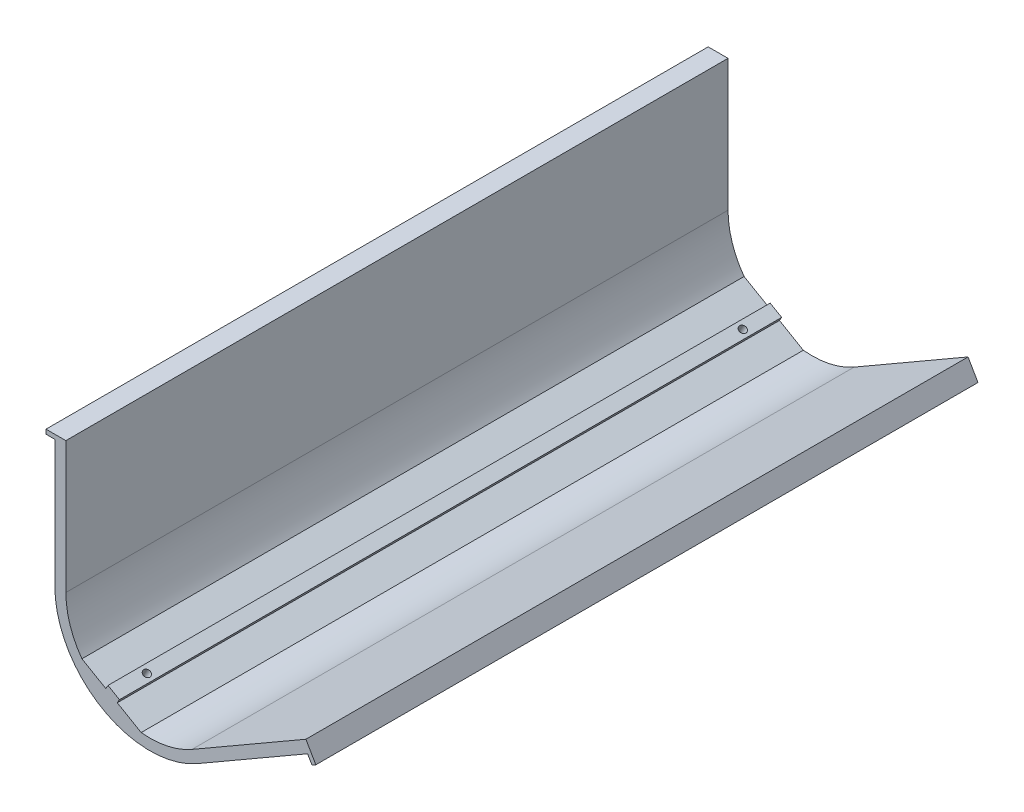
ISO-10303-21;
HEADER;
FILE_DESCRIPTION(('STEP AP214'),'2;1');
FILE_NAME('part.step','',(''),(''),'','','');
FILE_SCHEMA(('AUTOMOTIVE_DESIGN { 1 0 10303 214 1 1 1 1 }'));
ENDSEC;
DATA;
#1=APPLICATION_CONTEXT('core data for automotive mechanical design processes');
#2=APPLICATION_PROTOCOL_DEFINITION('international standard','automotive_design',2000,#1);
#3=PRODUCT_CONTEXT('',#1,'mechanical');
#4=PRODUCT('Part','Part','',(#3));
#5=PRODUCT_RELATED_PRODUCT_CATEGORY('part','',(#4));
#6=PRODUCT_DEFINITION_FORMATION('','',#4);
#7=PRODUCT_DEFINITION_CONTEXT('part definition',#1,'design');
#8=PRODUCT_DEFINITION('design','',#6,#7);
#9=PRODUCT_DEFINITION_SHAPE('','',#8);
#10=(LENGTH_UNIT() NAMED_UNIT(*) SI_UNIT(.MILLI.,.METRE.));
#11=(NAMED_UNIT(*) PLANE_ANGLE_UNIT() SI_UNIT($,.RADIAN.));
#12=(NAMED_UNIT(*) SI_UNIT($,.STERADIAN.) SOLID_ANGLE_UNIT());
#13=UNCERTAINTY_MEASURE_WITH_UNIT(LENGTH_MEASURE(1.E-05),#10,'distance_accuracy_value','');
#14=(GEOMETRIC_REPRESENTATION_CONTEXT(3) GLOBAL_UNCERTAINTY_ASSIGNED_CONTEXT((#13)) GLOBAL_UNIT_ASSIGNED_CONTEXT((#10,
#11,#12)) REPRESENTATION_CONTEXT('',''));
#15=CARTESIAN_POINT('',(0.,0.,0.));
#16=DIRECTION('',(0.,0.,1.));
#17=DIRECTION('',(1.,0.,0.));
#18=AXIS2_PLACEMENT_3D('',#15,#16,#17);
#19=CARTESIAN_POINT('',(2.27010102372575,-22.3839282625581,459.654933865598));
#20=DIRECTION('',(-0.499999999999999,-0.86602540378444,0.));
#21=DIRECTION('',(0.86602540378444,-0.499999999999999,0.));
#22=AXIS2_PLACEMENT_3D('',#19,#20,#21);
#23=PLANE('',#22);
#24=DIRECTION('',(0.,0.,1.));
#25=VECTOR('',#24,1.);
#26=CARTESIAN_POINT('',(13.0974318643345,-28.6350906379887,300.));
#27=LINE('',#26,#25);
#28=CARTESIAN_POINT('',(13.0974318643345,-28.6350906379887,0.));
#29=VERTEX_POINT('',#28);
#30=CARTESIAN_POINT('',(13.0974318643345,-28.6350906379887,300.));
#31=VERTEX_POINT('',#30);
#32=EDGE_CURVE('E53',#29,#31,#27,.T.);
#33=ORIENTED_EDGE('',*,*,#32,.F.);
#34=DIRECTION('',(-0.86602540378444,0.499999999999999,0.));
#35=VECTOR('',#34,1.);
#36=CARTESIAN_POINT('',(2.27010102372575,-22.3839282625581,0.));
#37=LINE('',#36,#35);
#38=CARTESIAN_POINT('',(2.27010102372574,-22.3839282625581,0.));
#39=VERTEX_POINT('',#38);
#40=EDGE_CURVE('E225',#29,#39,#37,.T.);
#41=ORIENTED_EDGE('',*,*,#40,.T.);
#42=DIRECTION('',(0.,0.,-1.));
#43=VECTOR('',#42,1.);
#44=CARTESIAN_POINT('',(2.27010102372574,-22.3839282625581,459.654933865598));
#45=LINE('',#44,#43);
#46=CARTESIAN_POINT('',(2.27010102372574,-22.3839282625581,300.));
#47=VERTEX_POINT('',#46);
#48=EDGE_CURVE('E221',#47,#39,#45,.T.);
#49=ORIENTED_EDGE('',*,*,#48,.F.);
#50=DIRECTION('',(-0.86602540378444,0.499999999999999,0.));
#51=VECTOR('',#50,1.);
#52=CARTESIAN_POINT('',(2.27010102372575,-22.3839282625581,300.));
#53=LINE('',#52,#51);
#54=EDGE_CURVE('E267',#31,#47,#53,.T.);
#55=ORIENTED_EDGE('',*,*,#54,.F.);
#56=EDGE_LOOP('',(#33,#41,#49,#55));
#57=FACE_BOUND('',#56,.T.);
#58=ADVANCED_FACE('F33',(#57),#23,.F.);
#59=DIRECTION('',(0.,0.,-1.));
#60=VECTOR('',#59,1.);
#61=CARTESIAN_POINT('',(18.2935842870411,-31.6350906379887,300.));
#62=LINE('',#61,#60);
#63=CARTESIAN_POINT('',(18.2935842870411,-31.6350906379887,300.));
#64=VERTEX_POINT('',#63);
#65=CARTESIAN_POINT('',(18.2935842870411,-31.6350906379887,0.));
#66=VERTEX_POINT('',#65);
#67=EDGE_CURVE('E182',#64,#66,#62,.T.);
#68=ORIENTED_EDGE('',*,*,#67,.F.);
#69=CARTESIAN_POINT('',(29.1209151276498,-37.8862530134192,300.));
#70=VERTEX_POINT('',#69);
#71=EDGE_CURVE('E265',#70,#64,#53,.T.);
#72=ORIENTED_EDGE('',*,*,#71,.F.);
#73=DIRECTION('',(0.,0.,-1.));
#74=VECTOR('',#73,1.);
#75=CARTESIAN_POINT('',(29.1209151276498,-37.8862530134192,459.654933865598));
#76=LINE('',#75,#74);
#77=CARTESIAN_POINT('',(29.1209151276498,-37.8862530134192,0.));
#78=VERTEX_POINT('',#77);
#79=EDGE_CURVE('E229',#70,#78,#76,.T.);
#80=ORIENTED_EDGE('',*,*,#79,.T.);
#81=EDGE_CURVE('E222',#78,#66,#37,.T.);
#82=ORIENTED_EDGE('',*,*,#81,.T.);
#83=EDGE_LOOP('',(#68,#72,#80,#82));
#84=FACE_BOUND('',#83,.T.);
#85=ADVANCED_FACE('F360',(#84),#23,.F.);
#86=CARTESIAN_POINT('',(33.0940107675842,0.,459.654933865598));
#87=DIRECTION('',(0.,0.,-1.));
#88=DIRECTION('',(-1.,0.,0.));
#89=AXIS2_PLACEMENT_3D('',#86,#87,#88);
#90=CYLINDRICAL_SURFACE('',#89,43.0940107675849);
#91=CARTESIAN_POINT('',(9.10518694657025,-35.799861671815,285.));
#92=CARTESIAN_POINT('',(9.10519244447353,-35.7998663266525,285.161297097093));
#93=CARTESIAN_POINT('',(9.11652316812617,-35.8074659248552,285.32270657392));
#94=CARTESIAN_POINT('',(9.16159802631115,-35.8376072181925,285.641066985922));
#95=CARTESIAN_POINT('',(9.19536812511742,-35.8601662225764,285.798012536322));
#96=CARTESIAN_POINT('',(9.28445875797792,-35.9193797442514,286.102787623212));
#97=CARTESIAN_POINT('',(9.33976776572867,-35.9560267223882,286.250621986524));
#98=CARTESIAN_POINT('',(9.47051911939522,-36.0420657217431,286.533038598448));
#99=CARTESIAN_POINT('',(9.54595691016941,-36.0914548593282,286.667623835914));
#100=CARTESIAN_POINT('',(9.71517680704267,-36.2012989670421,286.919987804878));
#101=CARTESIAN_POINT('',(9.80898618631744,-36.2617703804664,287.037741093674));
#102=CARTESIAN_POINT('',(10.0124622146195,-36.3916256307078,287.252880651108));
#103=CARTESIAN_POINT('',(10.1221295302732,-36.461009842182,287.350266063111));
#104=CARTESIAN_POINT('',(10.3545529188578,-36.6064147399901,287.521984909403));
#105=CARTESIAN_POINT('',(10.4773209078901,-36.6824414566216,287.596297112449));
#106=CARTESIAN_POINT('',(10.7325708372993,-36.838595646703,287.719624183307));
#107=CARTESIAN_POINT('',(10.8650526618639,-36.9187230712592,287.768639352663));
#108=CARTESIAN_POINT('',(11.1358908755815,-37.0804471556159,287.839909905808));
#109=CARTESIAN_POINT('',(11.2742381381263,-37.1620414267307,287.862205389749));
#110=CARTESIAN_POINT('',(11.5531171456246,-37.3243847083736,287.879527544094));
#111=CARTESIAN_POINT('',(11.6936488630598,-37.4051337295281,287.874554557732));
#112=CARTESIAN_POINT('',(11.9726571680676,-37.5633847751024,287.837513961301));
#113=CARTESIAN_POINT('',(12.1111366703706,-37.6408917624794,287.805489483915));
#114=CARTESIAN_POINT('',(12.3822568887193,-37.790753149233,287.715321921167));
#115=CARTESIAN_POINT('',(12.5148975664079,-37.8631075147624,287.657178664252));
#116=CARTESIAN_POINT('',(12.770543071781,-38.0009414950658,287.516375312336));
#117=CARTESIAN_POINT('',(12.8935401343535,-38.0664155839331,287.433695711658));
#118=CARTESIAN_POINT('',(13.1261155043288,-38.1889280804036,287.246180826693));
#119=CARTESIAN_POINT('',(13.2356936389436,-38.245966379386,287.141345257165));
#120=CARTESIAN_POINT('',(13.4383180949122,-38.3504962395822,286.912250817473));
#121=CARTESIAN_POINT('',(13.5313317908603,-38.3979689840718,286.787954502241));
#122=CARTESIAN_POINT('',(13.6977027205264,-38.4822780645245,286.523597950881));
#123=CARTESIAN_POINT('',(13.7710599451993,-38.5191143955932,286.383537707497));
#124=CARTESIAN_POINT('',(13.8958314683849,-38.5814536328349,286.091604706992));
#125=CARTESIAN_POINT('',(13.947244297232,-38.6069557799368,285.939731159511));
#126=CARTESIAN_POINT('',(14.0264906761579,-38.6461565118039,285.628493952112));
#127=CARTESIAN_POINT('',(14.0543245425335,-38.6598552549044,285.469130392698));
#128=CARTESIAN_POINT('',(14.0854935222108,-38.6751902858889,285.147765620562));
#129=CARTESIAN_POINT('',(14.088875733929,-38.67684976365,284.98577008139));
#130=CARTESIAN_POINT('',(14.0711577931146,-38.6681383367068,284.663450885273));
#131=CARTESIAN_POINT('',(14.0500577860039,-38.6577675034614,284.503127218403));
#132=CARTESIAN_POINT('',(13.984079768996,-38.6251943536176,284.188851302327));
#133=CARTESIAN_POINT('',(13.9392234513303,-38.603002830556,284.034893378508));
#134=CARTESIAN_POINT('',(13.8271632725371,-38.5471950603565,283.737543984934));
#135=CARTESIAN_POINT('',(13.7599591805395,-38.513578695191,283.59415262436));
#136=CARTESIAN_POINT('',(13.6051804337481,-38.435488196064,283.321766254255));
#137=CARTESIAN_POINT('',(13.5175748194409,-38.3909975551453,283.192793569926));
#138=CARTESIAN_POINT('',(13.3247482749117,-38.2920583983756,282.953130642489));
#139=CARTESIAN_POINT('',(13.21952714891,-38.2376097718503,282.842440602601));
#140=CARTESIAN_POINT('',(12.9944859369292,-38.1197978883274,282.642307773289));
#141=CARTESIAN_POINT('',(12.8746429974715,-38.0564206516239,282.552898906233));
#142=CARTESIAN_POINT('',(12.6240935984965,-37.9222417957547,282.398098649762));
#143=CARTESIAN_POINT('',(12.4933872135474,-37.8514402275497,282.332707095504));
#144=CARTESIAN_POINT('',(12.2251004680357,-37.704187082144,282.227856563488));
#145=CARTESIAN_POINT('',(12.0875258759193,-37.6277402212668,282.188376205066));
#146=CARTESIAN_POINT('',(11.8094260598235,-37.4711311969166,282.136398812612));
#147=CARTESIAN_POINT('',(11.6689008696931,-37.390969076052,282.123901469203));
#148=CARTESIAN_POINT('',(11.3892147817137,-37.2293115097064,282.126247952406));
#149=CARTESIAN_POINT('',(11.2500517644559,-37.1478189557116,282.141038732099));
#150=CARTESIAN_POINT('',(10.9767234348156,-36.9857353685124,282.197431503953));
#151=CARTESIAN_POINT('',(10.8425581309257,-36.9051443368402,282.239033541672));
#152=CARTESIAN_POINT('',(10.5829137161413,-36.7473451089797,282.347855622046));
#153=CARTESIAN_POINT('',(10.4574344813431,-36.6701368645429,282.415075299187));
#154=CARTESIAN_POINT('',(10.2185290308157,-36.5215814556957,282.573217511789));
#155=CARTESIAN_POINT('',(10.1051025246018,-36.4502341500393,282.664139475816));
#156=CARTESIAN_POINT('',(9.89308124331671,-36.3156503243752,282.867302345702));
#157=CARTESIAN_POINT('',(9.79451391062923,-36.2524288423668,282.979581851251));
#158=CARTESIAN_POINT('',(9.61498881558282,-36.1364186011862,283.222215969229));
#159=CARTESIAN_POINT('',(9.5340353602606,-36.0836323939894,283.352574989824));
#160=CARTESIAN_POINT('',(9.39174688472133,-35.9903281847304,283.627835036746));
#161=CARTESIAN_POINT('',(9.33043853945913,-35.9498268675561,283.772755487625));
#162=CARTESIAN_POINT('',(9.22920909909171,-35.8827079355814,284.072779367351));
#163=CARTESIAN_POINT('',(9.18926303646849,-35.8560741138832,284.227870669685));
#164=CARTESIAN_POINT('',(9.14210261175095,-35.8245769595269,284.48658744668));
#165=CARTESIAN_POINT('',(9.12827546427715,-35.8153238252842,284.588541978836));
#166=CARTESIAN_POINT('',(9.10981588029737,-35.8029646972843,284.793649007773));
#167=CARTESIAN_POINT('',(9.10518342899079,-35.7998586936321,284.896801502625));
#168=CARTESIAN_POINT('',(9.10518694657025,-35.799861671815,285.));
#169=B_SPLINE_CURVE_WITH_KNOTS('',3,(#91,#92,#93,#94,#95,#96,#97,#98,#99,#100,#101,#102,#103,
#104,#105,#106,#107,#108,#109,#110,#111,#112,#113,#114,#115,#116,#117,#118,#119,#120,#121,#122,
#123,#124,#125,#126,#127,#128,#129,#130,#131,#132,#133,#134,#135,#136,#137,#138,#139,#140,#141,
#142,#143,#144,#145,#146,#147,#148,#149,#150,#151,#152,#153,#154,#155,#156,#157,#158,#159,#160,
#161,#162,#163,#164,#165,#166,#167,#168),.UNSPECIFIED.,.T.,.F.,(4,2,2,2,2,2,2,2,2,2,2,2,2,2,2,2,
2,2,2,2,2,2,2,2,2,2,2,2,2,2,2,2,2,2,2,2,2,2,4),(0.,0.483514542357615,0.967589528847677,
1.45140582327215,1.935112722839,2.41954321885344,2.90399408498874,3.38888941544184,
3.87377896570989,4.3579398924167,4.84209472492526,5.32547904302915,5.80886653616381,
6.29263934239359,6.77641837723653,7.26113997387421,7.74586179356263,8.23061607107052,
8.71536384580417,9.19917765713678,9.68298859467953,10.1663585171958,10.6497334334575,
11.1338467116872,11.6179653707357,12.1028506270876,12.5877325553981,13.0722138779189,
13.556689645543,14.0402246056368,14.5237603873553,15.0072892701854,15.4908064967615,
15.9752060374027,16.4597238931478,16.9448968867766,17.4295015802977,17.7388565249918,
18.0482109717202),.UNSPECIFIED.);
#170=CARTESIAN_POINT('',(9.10518694657025,-35.799861671815,285.));
#171=VERTEX_POINT('',#170);
#172=EDGE_CURVE('E37',#171,#171,#169,.T.);
#173=ORIENTED_EDGE('',*,*,#172,.T.);
#174=EDGE_LOOP('',(#173));
#175=FACE_BOUND('',#174,.T.);
#176=CARTESIAN_POINT('',(9.10518694657026,-35.799861671815,15.));
#177=CARTESIAN_POINT('',(9.10519244447353,-35.7998663266525,15.1612970970931));
#178=CARTESIAN_POINT('',(9.11652316812617,-35.8074659248552,15.3227065739202));
#179=CARTESIAN_POINT('',(9.16159802631115,-35.8376072181925,15.6410669859224));
#180=CARTESIAN_POINT('',(9.19536812511742,-35.8601662225764,15.7980125363219));
#181=CARTESIAN_POINT('',(9.28445875797792,-35.9193797442514,16.1027876232124));
#182=CARTESIAN_POINT('',(9.33976776572868,-35.9560267223882,16.2506219865244));
#183=CARTESIAN_POINT('',(9.47051911939522,-36.0420657217431,16.5330385984478));
#184=CARTESIAN_POINT('',(9.5459569101694,-36.0914548593282,16.6676238359136));
#185=CARTESIAN_POINT('',(9.71517680704266,-36.2012989670421,16.919987804878));
#186=CARTESIAN_POINT('',(9.80898618631743,-36.2617703804664,17.0377410936741));
#187=CARTESIAN_POINT('',(10.0124622146195,-36.3916256307078,17.2528806511076));
#188=CARTESIAN_POINT('',(10.1221295302732,-36.461009842182,17.3502660631113));
#189=CARTESIAN_POINT('',(10.3545529188578,-36.6064147399901,17.5219849094027));
#190=CARTESIAN_POINT('',(10.47732090789,-36.6824414566216,17.5962971124491));
#191=CARTESIAN_POINT('',(10.7325708372993,-36.8385956467031,17.7196241833065));
#192=CARTESIAN_POINT('',(10.865052661864,-36.9187230712592,17.7686393526634));
#193=CARTESIAN_POINT('',(11.1358908755815,-37.0804471556159,17.8399099058084));
#194=CARTESIAN_POINT('',(11.2742381381263,-37.1620414267307,17.862205389749));
#195=CARTESIAN_POINT('',(11.5531171456246,-37.3243847083736,17.8795275440942));
#196=CARTESIAN_POINT('',(11.6936488630598,-37.4051337295281,17.8745545577315));
#197=CARTESIAN_POINT('',(11.9726571680676,-37.5633847751024,17.8375139613011));
#198=CARTESIAN_POINT('',(12.1111366703706,-37.6408917624794,17.8054894839145));
#199=CARTESIAN_POINT('',(12.3822568887194,-37.790753149233,17.715321921167));
#200=CARTESIAN_POINT('',(12.5148975664079,-37.8631075147624,17.6571786642518));
#201=CARTESIAN_POINT('',(12.770543071781,-38.0009414950658,17.5163753123363));
#202=CARTESIAN_POINT('',(12.8935401343535,-38.0664155839331,17.4336957116579));
#203=CARTESIAN_POINT('',(13.1261155043288,-38.1889280804036,17.2461808266934));
#204=CARTESIAN_POINT('',(13.2356936389436,-38.245966379386,17.1413452571648));
#205=CARTESIAN_POINT('',(13.4383180949122,-38.3504962395822,16.9122508174725));
#206=CARTESIAN_POINT('',(13.5313317908603,-38.3979689840718,16.7879545022411));
#207=CARTESIAN_POINT('',(13.6977027205264,-38.4822780645245,16.5235979508806));
#208=CARTESIAN_POINT('',(13.7710599451993,-38.5191143955932,16.3835377074974));
#209=CARTESIAN_POINT('',(13.8958314683849,-38.5814536328349,16.0916047069917));
#210=CARTESIAN_POINT('',(13.947244297232,-38.6069557799368,15.9397311595107));
#211=CARTESIAN_POINT('',(14.0264906761579,-38.6461565118039,15.6284939521119));
#212=CARTESIAN_POINT('',(14.0543245425336,-38.6598552549044,15.4691303926981));
#213=CARTESIAN_POINT('',(14.0854935222109,-38.6751902858889,15.1477656205615));
#214=CARTESIAN_POINT('',(14.088875733929,-38.67684976365,14.9857700813894));
#215=CARTESIAN_POINT('',(14.0711577931146,-38.6681383367068,14.6634508852726));
#216=CARTESIAN_POINT('',(14.0500577860039,-38.6577675034614,14.5031272184029));
#217=CARTESIAN_POINT('',(13.984079768996,-38.6251943536176,14.1888513023271));
#218=CARTESIAN_POINT('',(13.9392234513303,-38.603002830556,14.0348933785076));
#219=CARTESIAN_POINT('',(13.8271632725371,-38.5471950603565,13.7375439849343));
#220=CARTESIAN_POINT('',(13.7599591805396,-38.513578695191,13.5941526243602));
#221=CARTESIAN_POINT('',(13.6051804337481,-38.435488196064,13.3217662542546));
#222=CARTESIAN_POINT('',(13.5175748194409,-38.3909975551453,13.1927935699264));
#223=CARTESIAN_POINT('',(13.3247482749118,-38.2920583983756,12.9531306424889));
#224=CARTESIAN_POINT('',(13.21952714891,-38.2376097718503,12.842440602601));
#225=CARTESIAN_POINT('',(12.9944859369292,-38.1197978883274,12.6423077732891));
#226=CARTESIAN_POINT('',(12.8746429974715,-38.0564206516239,12.5528989062334));
#227=CARTESIAN_POINT('',(12.6240935984965,-37.9222417957547,12.3980986497617));
#228=CARTESIAN_POINT('',(12.4933872135474,-37.8514402275497,12.3327070955044));
#229=CARTESIAN_POINT('',(12.2251004680357,-37.704187082144,12.2278565634881));
#230=CARTESIAN_POINT('',(12.0875258759193,-37.6277402212668,12.188376205066));
#231=CARTESIAN_POINT('',(11.8094260598235,-37.4711311969166,12.1363988126115));
#232=CARTESIAN_POINT('',(11.6689008696931,-37.390969076052,12.1239014692027));
#233=CARTESIAN_POINT('',(11.3892147817138,-37.2293115097064,12.1262479524056));
#234=CARTESIAN_POINT('',(11.2500517644559,-37.1478189557116,12.1410387320989));
#235=CARTESIAN_POINT('',(10.9767234348156,-36.9857353685124,12.1974315039533));
#236=CARTESIAN_POINT('',(10.8425581309257,-36.9051443368402,12.239033541672));
#237=CARTESIAN_POINT('',(10.5829137161413,-36.7473451089797,12.3478556220465));
#238=CARTESIAN_POINT('',(10.4574344813431,-36.6701368645429,12.4150752991866));
#239=CARTESIAN_POINT('',(10.2185290308158,-36.5215814556957,12.5732175117887));
#240=CARTESIAN_POINT('',(10.1051025246018,-36.4502341500393,12.6641394758155));
#241=CARTESIAN_POINT('',(9.89308124331672,-36.3156503243752,12.8673023457015));
#242=CARTESIAN_POINT('',(9.79451391062925,-36.2524288423668,12.9795818512506));
#243=CARTESIAN_POINT('',(9.61498881558284,-36.1364186011862,13.2222159692288));
#244=CARTESIAN_POINT('',(9.53403536026061,-36.0836323939894,13.3525749898236));
#245=CARTESIAN_POINT('',(9.39174688472133,-35.9903281847304,13.6278350367465));
#246=CARTESIAN_POINT('',(9.33043853945913,-35.9498268675561,13.7727554876249));
#247=CARTESIAN_POINT('',(9.22920909909171,-35.8827079355814,14.0727793673509));
#248=CARTESIAN_POINT('',(9.1892630364685,-35.8560741138833,14.2278706696853));
#249=CARTESIAN_POINT('',(9.14210261175095,-35.8245769595269,14.4865874466799));
#250=CARTESIAN_POINT('',(9.12827546427715,-35.8153238252842,14.5885419788358));
#251=CARTESIAN_POINT('',(9.10981588029738,-35.8029646972843,14.7936490077728));
#252=CARTESIAN_POINT('',(9.1051834289908,-35.7998586936321,14.8968015026252));
#253=CARTESIAN_POINT('',(9.10518694657026,-35.799861671815,15.));
#254=B_SPLINE_CURVE_WITH_KNOTS('',3,(#176,#177,#178,#179,#180,#181,#182,#183,#184,#185,#186,
#187,#188,#189,#190,#191,#192,#193,#194,#195,#196,#197,#198,#199,#200,#201,#202,#203,#204,#205,
#206,#207,#208,#209,#210,#211,#212,#213,#214,#215,#216,#217,#218,#219,#220,#221,#222,#223,#224,
#225,#226,#227,#228,#229,#230,#231,#232,#233,#234,#235,#236,#237,#238,#239,#240,#241,#242,#243,
#244,#245,#246,#247,#248,#249,#250,#251,#252,#253),.UNSPECIFIED.,.T.,.F.,(4,2,2,2,2,2,2,2,2,2,2,
2,2,2,2,2,2,2,2,2,2,2,2,2,2,2,2,2,2,2,2,2,2,2,2,2,2,2,4),(0.,0.483514542357623,
0.967589528847684,1.45140582327213,1.935112722839,2.41954321885344,2.90399408498871,
3.38888941544184,3.8737789657099,4.35793989241672,4.84209472492527,5.32547904302916,
5.80886653616383,6.29263934239359,6.77641837723654,7.26113997387425,7.74586179356267,
8.23061607107055,8.71536384580422,9.1991776571369,9.68298859467958,10.1663585171957,
10.6497334334575,11.1338467116872,11.6179653707357,12.1028506270876,12.5877325553981,
13.0722138779189,13.556689645543,14.0402246056368,14.5237603873553,15.0072892701854,
15.4908064967616,15.9752060374027,16.4597238931479,16.9448968867766,17.4295015802977,
17.7388565249918,18.0482109717202),.UNSPECIFIED.);
#255=CARTESIAN_POINT('',(9.10518694657026,-35.799861671815,15.));
#256=VERTEX_POINT('',#255);
#257=EDGE_CURVE('E305',#256,#256,#254,.T.);
#258=ORIENTED_EDGE('',*,*,#257,.T.);
#259=EDGE_LOOP('',(#258));
#260=FACE_BOUND('',#259,.T.);
#261=CARTESIAN_POINT('',(33.0940107675842,0.,300.));
#262=DIRECTION('',(0.,0.,1.));
#263=DIRECTION('',(1.,0.,0.));
#264=AXIS2_PLACEMENT_3D('',#261,#262,#263);
#265=CIRCLE('',#264,43.0940107675849);
#266=CARTESIAN_POINT('',(-10.0000000000007,0.,300.));
#267=VERTEX_POINT('',#266);
#268=CARTESIAN_POINT('',(54.6410161513771,-37.3205080756885,300.));
#269=VERTEX_POINT('',#268);
#270=EDGE_CURVE('E286',#267,#269,#265,.T.);
#271=ORIENTED_EDGE('',*,*,#270,.F.);
#272=DIRECTION('',(0.,0.,-1.));
#273=VECTOR('',#272,1.);
#274=CARTESIAN_POINT('',(-10.0000000000007,0.,459.654933865598));
#275=LINE('',#274,#273);
#276=CARTESIAN_POINT('',(-10.0000000000007,0.,0.));
#277=VERTEX_POINT('',#276);
#278=EDGE_CURVE('E61',#267,#277,#275,.T.);
#279=ORIENTED_EDGE('',*,*,#278,.T.);
#280=CARTESIAN_POINT('',(33.0940107675842,0.,0.));
#281=DIRECTION('',(0.,0.,1.));
#282=DIRECTION('',(1.,0.,0.));
#283=AXIS2_PLACEMENT_3D('',#280,#281,#282);
#284=CIRCLE('',#283,43.0940107675849);
#285=CARTESIAN_POINT('',(54.6410161513771,-37.3205080756885,0.));
#286=VERTEX_POINT('',#285);
#287=EDGE_CURVE('E251',#277,#286,#284,.T.);
#288=ORIENTED_EDGE('',*,*,#287,.T.);
#289=DIRECTION('',(0.,0.,-1.));
#290=VECTOR('',#289,1.);
#291=CARTESIAN_POINT('',(54.6410161513771,-37.3205080756885,459.654933865598));
#292=LINE('',#291,#290);
#293=EDGE_CURVE('E250',#269,#286,#292,.T.);
#294=ORIENTED_EDGE('',*,*,#293,.F.);
#295=EDGE_LOOP('',(#271,#279,#288,#294));
#296=FACE_BOUND('',#295,.T.);
#297=ADVANCED_FACE('F312',(#175,#260,#296),#90,.T.);
#298=CARTESIAN_POINT('',(54.6410161513771,-37.3205080756885,459.654933865598));
#299=DIRECTION('',(-0.500000000000016,0.866025403784429,0.));
#300=DIRECTION('',(-0.866025403784429,-0.500000000000016,0.));
#301=AXIS2_PLACEMENT_3D('',#298,#299,#300);
#302=PLANE('',#301);
#303=DIRECTION('',(0.866025403784429,0.500000000000016,0.));
#304=VECTOR('',#303,1.);
#305=CARTESIAN_POINT('',(54.6410161513771,-37.3205080756885,300.));
#306=LINE('',#305,#304);
#307=CARTESIAN_POINT('',(104.518010155129,-8.52401216125157,300.));
#308=VERTEX_POINT('',#307);
#309=EDGE_CURVE('E283',#269,#308,#306,.T.);
#310=ORIENTED_EDGE('',*,*,#309,.F.);
#311=ORIENTED_EDGE('',*,*,#293,.T.);
#312=DIRECTION('',(0.866025403784429,0.500000000000016,0.));
#313=VECTOR('',#312,1.);
#314=CARTESIAN_POINT('',(54.6410161513771,-37.3205080756885,0.));
#315=LINE('',#314,#313);
#316=CARTESIAN_POINT('',(104.518010155129,-8.52401216125157,0.));
#317=VERTEX_POINT('',#316);
#318=EDGE_CURVE('E247',#286,#317,#315,.T.);
#319=ORIENTED_EDGE('',*,*,#318,.T.);
#320=DIRECTION('',(0.,0.,-1.));
#321=VECTOR('',#320,1.);
#322=CARTESIAN_POINT('',(104.518010155129,-8.52401216125157,459.654933865598));
#323=LINE('',#322,#321);
#324=EDGE_CURVE('E246',#308,#317,#323,.T.);
#325=ORIENTED_EDGE('',*,*,#324,.F.);
#326=EDGE_LOOP('',(#310,#311,#319,#325));
#327=FACE_BOUND('',#326,.T.);
#328=ADVANCED_FACE('F379',(#327),#302,.F.);
#329=CARTESIAN_POINT('',(104.518010155129,-8.52401216125157,459.654933865598));
#330=DIRECTION('',(0.86602540378443,0.500000000000015,0.));
#331=DIRECTION('',(-0.500000000000015,0.86602540378443,0.));
#332=AXIS2_PLACEMENT_3D('',#329,#330,#331);
#333=PLANE('',#332);
#334=DIRECTION('',(0.500000000000015,-0.86602540378443,0.));
#335=VECTOR('',#334,1.);
#336=CARTESIAN_POINT('',(104.518010155129,-8.52401216125157,300.));
#337=LINE('',#336,#335);
#338=CARTESIAN_POINT('',(106.518010155129,-11.9881137763893,300.));
#339=VERTEX_POINT('',#338);
#340=EDGE_CURVE('E280',#308,#339,#337,.T.);
#341=ORIENTED_EDGE('',*,*,#340,.F.);
#342=ORIENTED_EDGE('',*,*,#324,.T.);
#343=DIRECTION('',(0.500000000000015,-0.86602540378443,0.));
#344=VECTOR('',#343,1.);
#345=CARTESIAN_POINT('',(104.518010155129,-8.52401216125157,0.));
#346=LINE('',#345,#344);
#347=CARTESIAN_POINT('',(106.518010155129,-11.9881137763893,0.));
#348=VERTEX_POINT('',#347);
#349=EDGE_CURVE('E243',#317,#348,#346,.T.);
#350=ORIENTED_EDGE('',*,*,#349,.T.);
#351=DIRECTION('',(0.,0.,-1.));
#352=VECTOR('',#351,1.);
#353=CARTESIAN_POINT('',(106.518010155129,-11.9881137763893,459.654933865598));
#354=LINE('',#353,#352);
#355=EDGE_CURVE('E242',#339,#348,#354,.T.);
#356=ORIENTED_EDGE('',*,*,#355,.F.);
#357=EDGE_LOOP('',(#341,#342,#350,#356));
#358=FACE_BOUND('',#357,.T.);
#359=ADVANCED_FACE('F376',(#358),#333,.F.);
#360=CARTESIAN_POINT('',(106.518010155129,-11.9881137763893,459.654933865598));
#361=DIRECTION('',(-0.500000000000012,0.866025403784432,0.));
#362=DIRECTION('',(-0.866025403784432,-0.500000000000012,0.));
#363=AXIS2_PLACEMENT_3D('',#360,#361,#362);
#364=PLANE('',#363);
#365=DIRECTION('',(0.866025403784432,0.500000000000012,0.));
#366=VECTOR('',#365,1.);
#367=CARTESIAN_POINT('',(106.518010155129,-11.9881137763893,300.));
#368=LINE('',#367,#366);
#369=CARTESIAN_POINT('',(108.250060962698,-10.9881137763893,300.));
#370=VERTEX_POINT('',#369);
#371=EDGE_CURVE('E277',#339,#370,#368,.T.);
#372=ORIENTED_EDGE('',*,*,#371,.F.);
#373=ORIENTED_EDGE('',*,*,#355,.T.);
#374=DIRECTION('',(0.866025403784432,0.500000000000012,0.));
#375=VECTOR('',#374,1.);
#376=CARTESIAN_POINT('',(106.518010155129,-11.9881137763893,0.));
#377=LINE('',#376,#375);
#378=CARTESIAN_POINT('',(108.250060962698,-10.9881137763893,0.));
#379=VERTEX_POINT('',#378);
#380=EDGE_CURVE('E239',#348,#379,#377,.T.);
#381=ORIENTED_EDGE('',*,*,#380,.T.);
#382=DIRECTION('',(0.,0.,-1.));
#383=VECTOR('',#382,1.);
#384=CARTESIAN_POINT('',(108.250060962698,-10.9881137763893,459.654933865598));
#385=LINE('',#384,#383);
#386=EDGE_CURVE('E238',#370,#379,#385,.T.);
#387=ORIENTED_EDGE('',*,*,#386,.F.);
#388=EDGE_LOOP('',(#372,#373,#381,#387));
#389=FACE_BOUND('',#388,.T.);
#390=ADVANCED_FACE('F372',(#389),#364,.F.);
#391=CARTESIAN_POINT('',(106.250060962698,-7.52401216125177,459.654933865598));
#392=DIRECTION('',(-0.866025403784432,-0.500000000000011,0.));
#393=DIRECTION('',(0.500000000000011,-0.866025403784432,0.));
#394=AXIS2_PLACEMENT_3D('',#391,#392,#393);
#395=PLANE('',#394);
#396=DIRECTION('',(-0.500000000000011,0.866025403784432,0.));
#397=VECTOR('',#396,1.);
#398=CARTESIAN_POINT('',(106.250060962698,-7.52401216125177,300.));
#399=LINE('',#398,#397);
#400=CARTESIAN_POINT('',(103.750060962698,-3.19388514232939,300.));
#401=VERTEX_POINT('',#400);
#402=EDGE_CURVE('E274',#370,#401,#399,.T.);
#403=ORIENTED_EDGE('',*,*,#402,.F.);
#404=ORIENTED_EDGE('',*,*,#386,.T.);
#405=DIRECTION('',(-0.500000000000011,0.866025403784432,0.));
#406=VECTOR('',#405,1.);
#407=CARTESIAN_POINT('',(106.250060962698,-7.52401216125177,0.));
#408=LINE('',#407,#406);
#409=CARTESIAN_POINT('',(103.750060962698,-3.19388514232939,0.));
#410=VERTEX_POINT('',#409);
#411=EDGE_CURVE('E235',#379,#410,#408,.T.);
#412=ORIENTED_EDGE('',*,*,#411,.T.);
#413=DIRECTION('',(0.,0.,-1.));
#414=VECTOR('',#413,1.);
#415=CARTESIAN_POINT('',(103.750060962698,-3.19388514232939,459.654933865598));
#416=LINE('',#415,#414);
#417=EDGE_CURVE('E234',#401,#410,#416,.T.);
#418=ORIENTED_EDGE('',*,*,#417,.F.);
#419=EDGE_LOOP('',(#403,#404,#412,#418));
#420=FACE_BOUND('',#419,.T.);
#421=ADVANCED_FACE('F368',(#420),#395,.F.);
#422=CARTESIAN_POINT('',(52.1410161513771,-32.9903810567663,459.654933865598));
#423=DIRECTION('',(0.500000000000015,-0.86602540378443,0.));
#424=DIRECTION('',(0.86602540378443,0.500000000000015,0.));
#425=AXIS2_PLACEMENT_3D('',#422,#423,#424);
#426=PLANE('',#425);
#427=DIRECTION('',(-0.86602540378443,-0.500000000000015,0.));
#428=VECTOR('',#427,1.);
#429=CARTESIAN_POINT('',(52.1410161513771,-32.9903810567663,300.));
#430=LINE('',#429,#428);
#431=CARTESIAN_POINT('',(52.1410161513771,-32.9903810567663,300.));
#432=VERTEX_POINT('',#431);
#433=EDGE_CURVE('E271',#401,#432,#430,.T.);
#434=ORIENTED_EDGE('',*,*,#433,.F.);
#435=ORIENTED_EDGE('',*,*,#417,.T.);
#436=DIRECTION('',(-0.86602540378443,-0.500000000000015,0.));
#437=VECTOR('',#436,1.);
#438=CARTESIAN_POINT('',(52.1410161513771,-32.9903810567663,0.));
#439=LINE('',#438,#437);
#440=CARTESIAN_POINT('',(52.1410161513771,-32.9903810567663,0.));
#441=VERTEX_POINT('',#440);
#442=EDGE_CURVE('E231',#410,#441,#439,.T.);
#443=ORIENTED_EDGE('',*,*,#442,.T.);
#444=DIRECTION('',(0.,0.,-1.));
#445=VECTOR('',#444,1.);
#446=CARTESIAN_POINT('',(52.1410161513771,-32.9903810567663,459.654933865598));
#447=LINE('',#446,#445);
#448=EDGE_CURVE('E230',#432,#441,#447,.T.);
#449=ORIENTED_EDGE('',*,*,#448,.F.);
#450=EDGE_LOOP('',(#434,#435,#443,#449));
#451=FACE_BOUND('',#450,.T.);
#452=ADVANCED_FACE('F364',(#451),#426,.F.);
#453=CARTESIAN_POINT('',(33.0940107675842,0.,459.654933865598));
#454=DIRECTION('',(0.,0.,-1.));
#455=DIRECTION('',(-1.,0.,0.));
#456=AXIS2_PLACEMENT_3D('',#453,#454,#455);
#457=CYLINDRICAL_SURFACE('',#456,38.0940107675849);
#458=CARTESIAN_POINT('',(33.0940107675842,0.,300.));
#459=DIRECTION('',(0.,0.,1.));
#460=DIRECTION('',(1.,0.,0.));
#461=AXIS2_PLACEMENT_3D('',#458,#459,#460);
#462=CIRCLE('',#461,38.0940107675849);
#463=EDGE_CURVE('E268',#432,#70,#462,.F.);
#464=ORIENTED_EDGE('',*,*,#463,.F.);
#465=ORIENTED_EDGE('',*,*,#448,.T.);
#466=CARTESIAN_POINT('',(33.0940107675842,0.,0.));
#467=DIRECTION('',(0.,0.,-1.));
#468=DIRECTION('',(1.,0.,0.));
#469=AXIS2_PLACEMENT_3D('',#466,#467,#468);
#470=CIRCLE('',#469,38.0940107675849);
#471=EDGE_CURVE('E226',#441,#78,#470,.T.);
#472=ORIENTED_EDGE('',*,*,#471,.T.);
#473=ORIENTED_EDGE('',*,*,#79,.F.);
#474=EDGE_LOOP('',(#464,#465,#472,#473));
#475=FACE_BOUND('',#474,.T.);
#476=ADVANCED_FACE('F356',(#475),#457,.F.);
#477=CARTESIAN_POINT('',(33.0940107675842,0.,459.654933865598));
#478=DIRECTION('',(0.,0.,-1.));
#479=DIRECTION('',(-1.,0.,0.));
#480=AXIS2_PLACEMENT_3D('',#477,#478,#479);
#481=CYLINDRICAL_SURFACE('',#480,38.0940107675849);
#482=CARTESIAN_POINT('',(33.0940107675842,0.,300.));
#483=DIRECTION('',(0.,0.,1.));
#484=DIRECTION('',(1.,0.,0.));
#485=AXIS2_PLACEMENT_3D('',#482,#483,#484);
#486=CIRCLE('',#485,38.0940107675849);
#487=CARTESIAN_POINT('',(-5.00000000000073,0.,300.));
#488=VERTEX_POINT('',#487);
#489=EDGE_CURVE('E262',#47,#488,#486,.F.);
#490=ORIENTED_EDGE('',*,*,#489,.F.);
#491=ORIENTED_EDGE('',*,*,#48,.T.);
#492=CARTESIAN_POINT('',(33.0940107675842,0.,0.));
#493=DIRECTION('',(0.,0.,-1.));
#494=DIRECTION('',(1.,0.,0.));
#495=AXIS2_PLACEMENT_3D('',#492,#493,#494);
#496=CIRCLE('',#495,38.0940107675849);
#497=CARTESIAN_POINT('',(-5.00000000000073,0.,0.));
#498=VERTEX_POINT('',#497);
#499=EDGE_CURVE('E218',#39,#498,#496,.T.);
#500=ORIENTED_EDGE('',*,*,#499,.T.);
#501=DIRECTION('',(0.,0.,-1.));
#502=VECTOR('',#501,1.);
#503=CARTESIAN_POINT('',(-5.00000000000073,0.,459.654933865598));
#504=LINE('',#503,#502);
#505=EDGE_CURVE('E217',#488,#498,#504,.T.);
#506=ORIENTED_EDGE('',*,*,#505,.F.);
#507=EDGE_LOOP('',(#490,#491,#500,#506));
#508=FACE_BOUND('',#507,.T.);
#509=ADVANCED_FACE('F352',(#508),#481,.F.);
#510=CARTESIAN_POINT('',(-5.00000000000073,0.,459.654933865598));
#511=DIRECTION('',(-1.,0.,0.));
#512=DIRECTION('',(0.,-1.,0.));
#513=AXIS2_PLACEMENT_3D('',#510,#511,#512);
#514=PLANE('',#513);
#515=DIRECTION('',(0.,1.,0.));
#516=VECTOR('',#515,1.);
#517=CARTESIAN_POINT('',(-5.00000000000073,0.,300.));
#518=LINE('',#517,#516);
#519=CARTESIAN_POINT('',(-5.00000000000044,59.5929918288719,300.));
#520=VERTEX_POINT('',#519);
#521=EDGE_CURVE('E259',#488,#520,#518,.T.);
#522=ORIENTED_EDGE('',*,*,#521,.F.);
#523=ORIENTED_EDGE('',*,*,#505,.T.);
#524=DIRECTION('',(0.,1.,0.));
#525=VECTOR('',#524,1.);
#526=CARTESIAN_POINT('',(-5.00000000000073,0.,0.));
#527=LINE('',#526,#525);
#528=CARTESIAN_POINT('',(-5.00000000000044,59.5929918288719,0.));
#529=VERTEX_POINT('',#528);
#530=EDGE_CURVE('E214',#498,#529,#527,.T.);
#531=ORIENTED_EDGE('',*,*,#530,.T.);
#532=DIRECTION('',(0.,0.,-1.));
#533=VECTOR('',#532,1.);
#534=CARTESIAN_POINT('',(-5.00000000000044,59.5929918288719,459.654933865598));
#535=LINE('',#534,#533);
#536=EDGE_CURVE('E213',#520,#529,#535,.T.);
#537=ORIENTED_EDGE('',*,*,#536,.F.);
#538=EDGE_LOOP('',(#522,#523,#531,#537));
#539=FACE_BOUND('',#538,.T.);
#540=ADVANCED_FACE('F348',(#539),#514,.F.);
#541=CARTESIAN_POINT('',(-14.0000000000004,59.5929918288719,459.654933865598));
#542=DIRECTION('',(0.,-1.,0.));
#543=DIRECTION('',(0.,0.,-1.));
#544=AXIS2_PLACEMENT_3D('',#541,#542,#543);
#545=PLANE('',#544);
#546=DIRECTION('',(-1.,0.,0.));
#547=VECTOR('',#546,1.);
#548=CARTESIAN_POINT('',(-14.0000000000004,59.5929918288719,300.));
#549=LINE('',#548,#547);
#550=CARTESIAN_POINT('',(-14.0000000000004,59.5929918288719,300.));
#551=VERTEX_POINT('',#550);
#552=EDGE_CURVE('E256',#520,#551,#549,.T.);
#553=ORIENTED_EDGE('',*,*,#552,.F.);
#554=ORIENTED_EDGE('',*,*,#536,.T.);
#555=DIRECTION('',(-1.,0.,0.));
#556=VECTOR('',#555,1.);
#557=CARTESIAN_POINT('',(-14.0000000000004,59.5929918288719,0.));
#558=LINE('',#557,#556);
#559=CARTESIAN_POINT('',(-14.0000000000004,59.5929918288719,0.));
#560=VERTEX_POINT('',#559);
#561=EDGE_CURVE('E210',#529,#560,#558,.T.);
#562=ORIENTED_EDGE('',*,*,#561,.T.);
#563=DIRECTION('',(0.,0.,-1.));
#564=VECTOR('',#563,1.);
#565=CARTESIAN_POINT('',(-14.0000000000004,59.5929918288719,459.654933865598));
#566=LINE('',#565,#564);
#567=EDGE_CURVE('E209',#551,#560,#566,.T.);
#568=ORIENTED_EDGE('',*,*,#567,.F.);
#569=EDGE_LOOP('',(#553,#554,#562,#568));
#570=FACE_BOUND('',#569,.T.);
#571=ADVANCED_FACE('F344',(#570),#545,.F.);
#572=CARTESIAN_POINT('',(-14.0000000000004,57.592991828872,459.654933865598));
#573=DIRECTION('',(1.,0.,0.));
#574=DIRECTION('',(0.,0.,-1.));
#575=AXIS2_PLACEMENT_3D('',#572,#573,#574);
#576=PLANE('',#575);
#577=DIRECTION('',(0.,-1.,0.));
#578=VECTOR('',#577,1.);
#579=CARTESIAN_POINT('',(-14.0000000000004,57.592991828872,300.));
#580=LINE('',#579,#578);
#581=CARTESIAN_POINT('',(-14.0000000000004,57.592991828872,300.));
#582=VERTEX_POINT('',#581);
#583=EDGE_CURVE('E45',#551,#582,#580,.T.);
#584=ORIENTED_EDGE('',*,*,#583,.F.);
#585=ORIENTED_EDGE('',*,*,#567,.T.);
#586=DIRECTION('',(0.,-1.,0.));
#587=VECTOR('',#586,1.);
#588=CARTESIAN_POINT('',(-14.0000000000004,57.592991828872,0.));
#589=LINE('',#588,#587);
#590=CARTESIAN_POINT('',(-14.0000000000004,57.592991828872,0.));
#591=VERTEX_POINT('',#590);
#592=EDGE_CURVE('E206',#560,#591,#589,.T.);
#593=ORIENTED_EDGE('',*,*,#592,.T.);
#594=DIRECTION('',(0.,0.,-1.));
#595=VECTOR('',#594,1.);
#596=CARTESIAN_POINT('',(-14.0000000000004,57.592991828872,459.654933865598));
#597=LINE('',#596,#595);
#598=EDGE_CURVE('E205',#582,#591,#597,.T.);
#599=ORIENTED_EDGE('',*,*,#598,.F.);
#600=EDGE_LOOP('',(#584,#585,#593,#599));
#601=FACE_BOUND('',#600,.T.);
#602=ADVANCED_FACE('F340',(#601),#576,.F.);
#603=CARTESIAN_POINT('',(-10.0000000000004,57.592991828872,459.654933865598));
#604=DIRECTION('',(0.,1.,0.));
#605=DIRECTION('',(0.,0.,1.));
#606=AXIS2_PLACEMENT_3D('',#603,#604,#605);
#607=PLANE('',#606);
#608=DIRECTION('',(1.,0.,0.));
#609=VECTOR('',#608,1.);
#610=CARTESIAN_POINT('',(-10.0000000000004,57.592991828872,300.));
#611=LINE('',#610,#609);
#612=CARTESIAN_POINT('',(-10.0000000000004,57.592991828872,300.));
#613=VERTEX_POINT('',#612);
#614=EDGE_CURVE('E11',#582,#613,#611,.T.);
#615=ORIENTED_EDGE('',*,*,#614,.F.);
#616=ORIENTED_EDGE('',*,*,#598,.T.);
#617=DIRECTION('',(1.,0.,0.));
#618=VECTOR('',#617,1.);
#619=CARTESIAN_POINT('',(-10.0000000000004,57.592991828872,0.));
#620=LINE('',#619,#618);
#621=CARTESIAN_POINT('',(-10.0000000000004,57.592991828872,0.));
#622=VERTEX_POINT('',#621);
#623=EDGE_CURVE('E202',#591,#622,#620,.T.);
#624=ORIENTED_EDGE('',*,*,#623,.T.);
#625=DIRECTION('',(0.,0.,-1.));
#626=VECTOR('',#625,1.);
#627=CARTESIAN_POINT('',(-10.0000000000004,57.592991828872,459.654933865598));
#628=LINE('',#627,#626);
#629=EDGE_CURVE('E201',#613,#622,#628,.T.);
#630=ORIENTED_EDGE('',*,*,#629,.F.);
#631=EDGE_LOOP('',(#615,#616,#624,#630));
#632=FACE_BOUND('',#631,.T.);
#633=ADVANCED_FACE('F337',(#632),#607,.F.);
#634=CARTESIAN_POINT('',(-10.0000000000007,0.,459.654933865598));
#635=DIRECTION('',(1.,0.,0.));
#636=DIRECTION('',(0.,1.,0.));
#637=AXIS2_PLACEMENT_3D('',#634,#635,#636);
#638=PLANE('',#637);
#639=DIRECTION('',(0.,-1.,0.));
#640=VECTOR('',#639,1.);
#641=CARTESIAN_POINT('',(-10.0000000000007,0.,300.));
#642=LINE('',#641,#640);
#643=EDGE_CURVE('E200',#613,#267,#642,.T.);
#644=ORIENTED_EDGE('',*,*,#643,.F.);
#645=ORIENTED_EDGE('',*,*,#629,.T.);
#646=DIRECTION('',(0.,-1.,0.));
#647=VECTOR('',#646,1.);
#648=CARTESIAN_POINT('',(-10.0000000000007,0.,0.));
#649=LINE('',#648,#647);
#650=EDGE_CURVE('E198',#622,#277,#649,.T.);
#651=ORIENTED_EDGE('',*,*,#650,.T.);
#652=ORIENTED_EDGE('',*,*,#278,.F.);
#653=EDGE_LOOP('',(#644,#645,#651,#652));
#654=FACE_BOUND('',#653,.T.);
#655=ADVANCED_FACE('F333',(#654),#638,.F.);
#656=CARTESIAN_POINT('',(33.0940107675842,0.,0.));
#657=DIRECTION('',(0.,0.,1.));
#658=DIRECTION('',(1.,0.,0.));
#659=AXIS2_PLACEMENT_3D('',#656,#657,#658);
#660=PLANE('',#659);
#661=ORIENTED_EDGE('',*,*,#287,.F.);
#662=ORIENTED_EDGE('',*,*,#650,.F.);
#663=ORIENTED_EDGE('',*,*,#623,.F.);
#664=ORIENTED_EDGE('',*,*,#592,.F.);
#665=ORIENTED_EDGE('',*,*,#561,.F.);
#666=ORIENTED_EDGE('',*,*,#530,.F.);
#667=ORIENTED_EDGE('',*,*,#499,.F.);
#668=ORIENTED_EDGE('',*,*,#40,.F.);
#669=DIRECTION('',(-0.499999999999999,-0.86602540378444,0.));
#670=VECTOR('',#669,1.);
#671=CARTESIAN_POINT('',(14.0974318643345,-26.9030398304198,0.));
#672=LINE('',#671,#670);
#673=CARTESIAN_POINT('',(14.0974318643345,-26.9030398304198,0.));
#674=VERTEX_POINT('',#673);
#675=EDGE_CURVE('E417',#674,#29,#672,.T.);
#676=ORIENTED_EDGE('',*,*,#675,.F.);
#677=DIRECTION('',(-0.86602540378444,0.499999999999998,0.));
#678=VECTOR('',#677,1.);
#679=CARTESIAN_POINT('',(19.2935842870411,-29.9030398304198,0.));
#680=LINE('',#679,#678);
#681=CARTESIAN_POINT('',(19.2935842870411,-29.9030398304198,0.));
#682=VERTEX_POINT('',#681);
#683=EDGE_CURVE('E180',#682,#674,#680,.T.);
#684=ORIENTED_EDGE('',*,*,#683,.F.);
#685=DIRECTION('',(-0.499999999999999,-0.86602540378444,0.));
#686=VECTOR('',#685,1.);
#687=CARTESIAN_POINT('',(19.2935842870411,-29.9030398304198,0.));
#688=LINE('',#687,#686);
#689=EDGE_CURVE('E190',#682,#66,#688,.T.);
#690=ORIENTED_EDGE('',*,*,#689,.T.);
#691=ORIENTED_EDGE('',*,*,#81,.F.);
#692=ORIENTED_EDGE('',*,*,#471,.F.);
#693=ORIENTED_EDGE('',*,*,#442,.F.);
#694=ORIENTED_EDGE('',*,*,#411,.F.);
#695=ORIENTED_EDGE('',*,*,#380,.F.);
#696=ORIENTED_EDGE('',*,*,#349,.F.);
#697=ORIENTED_EDGE('',*,*,#318,.F.);
#698=EDGE_LOOP('',(#661,#662,#663,#664,#665,#666,#667,#668,#676,#684,#690,#691,#692,#693,#694,
#695,#696,#697));
#699=FACE_BOUND('',#698,.T.);
#700=ADVANCED_FACE('F330',(#699),#660,.F.);
#701=CARTESIAN_POINT('',(2.40511359340034,105.4,300.));
#702=DIRECTION('',(0.,0.,1.));
#703=DIRECTION('',(1.,0.,0.));
#704=AXIS2_PLACEMENT_3D('',#701,#702,#703);
#705=PLANE('',#704);
#706=ORIENTED_EDGE('',*,*,#643,.T.);
#707=ORIENTED_EDGE('',*,*,#270,.T.);
#708=ORIENTED_EDGE('',*,*,#309,.T.);
#709=ORIENTED_EDGE('',*,*,#340,.T.);
#710=ORIENTED_EDGE('',*,*,#371,.T.);
#711=ORIENTED_EDGE('',*,*,#402,.T.);
#712=ORIENTED_EDGE('',*,*,#433,.T.);
#713=ORIENTED_EDGE('',*,*,#463,.T.);
#714=ORIENTED_EDGE('',*,*,#71,.T.);
#715=DIRECTION('',(-0.499999999999999,-0.86602540378444,0.));
#716=VECTOR('',#715,1.);
#717=CARTESIAN_POINT('',(19.2935842870411,-29.9030398304198,300.));
#718=LINE('',#717,#716);
#719=CARTESIAN_POINT('',(19.2935842870411,-29.9030398304198,300.));
#720=VERTEX_POINT('',#719);
#721=EDGE_CURVE('E170',#720,#64,#718,.T.);
#722=ORIENTED_EDGE('',*,*,#721,.F.);
#723=DIRECTION('',(0.86602540378444,-0.499999999999998,0.));
#724=VECTOR('',#723,1.);
#725=CARTESIAN_POINT('',(19.2935842870411,-29.9030398304198,300.));
#726=LINE('',#725,#724);
#727=CARTESIAN_POINT('',(14.0974318643345,-26.9030398304198,300.));
#728=VERTEX_POINT('',#727);
#729=EDGE_CURVE('E164',#728,#720,#726,.T.);
#730=ORIENTED_EDGE('',*,*,#729,.F.);
#731=DIRECTION('',(-0.499999999999999,-0.86602540378444,0.));
#732=VECTOR('',#731,1.);
#733=CARTESIAN_POINT('',(14.0974318643345,-26.9030398304198,300.));
#734=LINE('',#733,#732);
#735=EDGE_CURVE('E167',#728,#31,#734,.T.);
#736=ORIENTED_EDGE('',*,*,#735,.T.);
#737=ORIENTED_EDGE('',*,*,#54,.T.);
#738=ORIENTED_EDGE('',*,*,#489,.T.);
#739=ORIENTED_EDGE('',*,*,#521,.T.);
#740=ORIENTED_EDGE('',*,*,#552,.T.);
#741=ORIENTED_EDGE('',*,*,#583,.T.);
#742=ORIENTED_EDGE('',*,*,#614,.T.);
#743=EDGE_LOOP('',(#706,#707,#708,#709,#710,#711,#712,#713,#714,#722,#730,#736,#737,#738,#739,
#740,#741,#742));
#744=FACE_BOUND('',#743,.T.);
#745=ADVANCED_FACE('F35',(#744),#705,.T.);
#746=CARTESIAN_POINT('',(2.66025403784381,-52.7128129211019,15.));
#747=DIRECTION('',(0.499999999999999,0.866025403784439,0.));
#748=DIRECTION('',(-0.866025403784439,0.499999999999999,0.));
#749=AXIS2_PLACEMENT_3D('',#746,#747,#748);
#750=CYLINDRICAL_SURFACE('',#749,1.60000000000001);
#751=CARTESIAN_POINT('',(14.6955080756878,-31.8671414455576,15.));
#752=DIRECTION('',(0.499999999999999,0.866025403784439,0.));
#753=DIRECTION('',(-0.866025403784439,0.499999999999999,0.));
#754=AXIS2_PLACEMENT_3D('',#751,#752,#753);
#755=CIRCLE('',#754,1.60000000000001);
#756=CARTESIAN_POINT('',(13.3098674296327,-31.0671414455575,15.));
#757=VERTEX_POINT('',#756);
#758=EDGE_CURVE('E197',#757,#757,#755,.F.);
#759=ORIENTED_EDGE('',*,*,#758,.T.);
#760=EDGE_LOOP('',(#759));
#761=FACE_BOUND('',#760,.T.);
#762=CARTESIAN_POINT('',(16.6955080756878,-28.4030398304198,15.));
#763=DIRECTION('',(0.499999999999999,0.86602540378444,0.));
#764=DIRECTION('',(-0.86602540378444,0.499999999999999,0.));
#765=AXIS2_PLACEMENT_3D('',#762,#763,#764);
#766=CIRCLE('',#765,1.60000000000001);
#767=CARTESIAN_POINT('',(15.3098674296327,-27.6030398304198,15.));
#768=VERTEX_POINT('',#767);
#769=EDGE_CURVE('E413',#768,#768,#766,.T.);
#770=ORIENTED_EDGE('',*,*,#769,.T.);
#771=EDGE_LOOP('',(#770));
#772=FACE_BOUND('',#771,.T.);
#773=ADVANCED_FACE('F325',(#761,#772),#750,.F.);
#774=CARTESIAN_POINT('',(2.6602540378438,-52.7128129211019,285.));
#775=DIRECTION('',(0.499999999999999,0.866025403784439,0.));
#776=DIRECTION('',(-0.866025403784439,0.499999999999999,0.));
#777=AXIS2_PLACEMENT_3D('',#774,#775,#776);
#778=CYLINDRICAL_SURFACE('',#777,1.60000000000001);
#779=CARTESIAN_POINT('',(14.6955080756878,-31.8671414455575,285.));
#780=DIRECTION('',(0.499999999999999,0.866025403784439,0.));
#781=DIRECTION('',(-0.866025403784439,0.499999999999999,0.));
#782=AXIS2_PLACEMENT_3D('',#779,#780,#781);
#783=CIRCLE('',#782,1.60000000000001);
#784=CARTESIAN_POINT('',(13.3098674296327,-31.0671414455575,285.));
#785=VERTEX_POINT('',#784);
#786=EDGE_CURVE('E188',#785,#785,#783,.F.);
#787=ORIENTED_EDGE('',*,*,#786,.T.);
#788=EDGE_LOOP('',(#787));
#789=FACE_BOUND('',#788,.T.);
#790=CARTESIAN_POINT('',(16.6955080756878,-28.4030398304198,285.));
#791=DIRECTION('',(0.499999999999999,0.86602540378444,0.));
#792=DIRECTION('',(-0.86602540378444,0.499999999999999,0.));
#793=AXIS2_PLACEMENT_3D('',#790,#791,#792);
#794=CIRCLE('',#793,1.6);
#795=CARTESIAN_POINT('',(15.3098674296327,-27.6030398304198,285.));
#796=VERTEX_POINT('',#795);
#797=EDGE_CURVE('E423',#796,#796,#794,.T.);
#798=ORIENTED_EDGE('',*,*,#797,.T.);
#799=EDGE_LOOP('',(#798));
#800=FACE_BOUND('',#799,.T.);
#801=ADVANCED_FACE('F321',(#789,#800),#778,.F.);
#802=CARTESIAN_POINT('',(2.66025403784381,-52.7128129211019,15.));
#803=DIRECTION('',(0.499999999999999,0.866025403784439,0.));
#804=DIRECTION('',(-0.866025403784439,0.499999999999999,0.));
#805=AXIS2_PLACEMENT_3D('',#802,#803,#804);
#806=CYLINDRICAL_SURFACE('',#805,2.875);
#807=CARTESIAN_POINT('',(14.6955080756878,-31.8671414455576,15.));
#808=DIRECTION('',(0.499999999999999,0.866025403784439,0.));
#809=DIRECTION('',(-0.866025403784439,0.499999999999999,0.));
#810=AXIS2_PLACEMENT_3D('',#807,#808,#809);
#811=CIRCLE('',#810,2.875);
#812=CARTESIAN_POINT('',(12.2056850398075,-30.4296414455576,15.));
#813=VERTEX_POINT('',#812);
#814=EDGE_CURVE('E194',#813,#813,#811,.T.);
#815=ORIENTED_EDGE('',*,*,#814,.T.);
#816=EDGE_LOOP('',(#815));
#817=FACE_BOUND('',#816,.T.);
#818=ORIENTED_EDGE('',*,*,#257,.F.);
#819=EDGE_LOOP('',(#818));
#820=FACE_BOUND('',#819,.T.);
#821=ADVANCED_FACE('F315',(#817,#820),#806,.F.);
#822=CARTESIAN_POINT('',(14.6955080756878,-31.8671414455576,15.));
#823=DIRECTION('',(0.499999999999999,0.866025403784439,0.));
#824=DIRECTION('',(-0.866025403784439,0.499999999999999,0.));
#825=AXIS2_PLACEMENT_3D('',#822,#823,#824);
#826=PLANE('',#825);
#827=ORIENTED_EDGE('',*,*,#814,.F.);
#828=EDGE_LOOP('',(#827));
#829=FACE_BOUND('',#828,.T.);
#830=ORIENTED_EDGE('',*,*,#758,.F.);
#831=EDGE_LOOP('',(#830));
#832=FACE_BOUND('',#831,.T.);
#833=ADVANCED_FACE('F320',(#829,#832),#826,.F.);
#834=CARTESIAN_POINT('',(2.6602540378438,-52.7128129211019,285.));
#835=DIRECTION('',(0.499999999999999,0.866025403784439,0.));
#836=DIRECTION('',(-0.866025403784439,0.499999999999999,0.));
#837=AXIS2_PLACEMENT_3D('',#834,#835,#836);
#838=CYLINDRICAL_SURFACE('',#837,2.87499999999999);
#839=CARTESIAN_POINT('',(14.6955080756878,-31.8671414455575,285.));
#840=DIRECTION('',(0.499999999999999,0.866025403784439,0.));
#841=DIRECTION('',(-0.866025403784439,0.499999999999999,0.));
#842=AXIS2_PLACEMENT_3D('',#839,#840,#841);
#843=CIRCLE('',#842,2.87499999999999);
#844=CARTESIAN_POINT('',(12.2056850398075,-30.4296414455576,285.));
#845=VERTEX_POINT('',#844);
#846=EDGE_CURVE('E185',#845,#845,#843,.T.);
#847=ORIENTED_EDGE('',*,*,#846,.T.);
#848=EDGE_LOOP('',(#847));
#849=FACE_BOUND('',#848,.T.);
#850=ORIENTED_EDGE('',*,*,#172,.F.);
#851=EDGE_LOOP('',(#850));
#852=FACE_BOUND('',#851,.T.);
#853=ADVANCED_FACE('F436',(#849,#852),#838,.F.);
#854=CARTESIAN_POINT('',(14.6955080756878,-31.8671414455575,285.));
#855=DIRECTION('',(0.499999999999999,0.866025403784439,0.));
#856=DIRECTION('',(-0.866025403784439,0.499999999999999,0.));
#857=AXIS2_PLACEMENT_3D('',#854,#855,#856);
#858=PLANE('',#857);
#859=ORIENTED_EDGE('',*,*,#846,.F.);
#860=EDGE_LOOP('',(#859));
#861=FACE_BOUND('',#860,.T.);
#862=ORIENTED_EDGE('',*,*,#786,.F.);
#863=EDGE_LOOP('',(#862));
#864=FACE_BOUND('',#863,.T.);
#865=ADVANCED_FACE('F428',(#861,#864),#858,.F.);
#866=CARTESIAN_POINT('',(-8.12500000000045,-14.072912811498,0.));
#867=DIRECTION('',(0.499999999999998,0.86602540378444,0.));
#868=DIRECTION('',(-0.86602540378444,0.499999999999998,0.));
#869=AXIS2_PLACEMENT_3D('',#866,#867,#868);
#870=PLANE('',#869);
#871=ORIENTED_EDGE('',*,*,#769,.F.);
#872=EDGE_LOOP('',(#871));
#873=FACE_BOUND('',#872,.T.);
#874=DIRECTION('',(0.,0.,1.));
#875=VECTOR('',#874,1.);
#876=CARTESIAN_POINT('',(14.0974318643345,-26.9030398304198,300.));
#877=LINE('',#876,#875);
#878=EDGE_CURVE('E174',#674,#728,#877,.T.);
#879=ORIENTED_EDGE('',*,*,#878,.T.);
#880=ORIENTED_EDGE('',*,*,#729,.T.);
#881=DIRECTION('',(0.,0.,-1.));
#882=VECTOR('',#881,1.);
#883=CARTESIAN_POINT('',(19.2935842870411,-29.9030398304198,300.));
#884=LINE('',#883,#882);
#885=EDGE_CURVE('E173',#720,#682,#884,.T.);
#886=ORIENTED_EDGE('',*,*,#885,.T.);
#887=ORIENTED_EDGE('',*,*,#683,.T.);
#888=EDGE_LOOP('',(#879,#880,#886,#887));
#889=FACE_BOUND('',#888,.T.);
#890=ORIENTED_EDGE('',*,*,#797,.F.);
#891=EDGE_LOOP('',(#890));
#892=FACE_BOUND('',#891,.T.);
#893=ADVANCED_FACE('F177',(#873,#889,#892),#870,.T.);
#894=CARTESIAN_POINT('',(14.0974318643345,-26.9030398304198,300.));
#895=DIRECTION('',(0.86602540378444,-0.499999999999999,0.));
#896=DIRECTION('',(0.499999999999999,0.86602540378444,0.));
#897=AXIS2_PLACEMENT_3D('',#894,#895,#896);
#898=PLANE('',#897);
#899=ORIENTED_EDGE('',*,*,#32,.T.);
#900=ORIENTED_EDGE('',*,*,#735,.F.);
#901=ORIENTED_EDGE('',*,*,#878,.F.);
#902=ORIENTED_EDGE('',*,*,#675,.T.);
#903=EDGE_LOOP('',(#899,#900,#901,#902));
#904=FACE_BOUND('',#903,.T.);
#905=ADVANCED_FACE('F184',(#904),#898,.F.);
#906=CARTESIAN_POINT('',(19.2935842870411,-29.9030398304198,300.));
#907=DIRECTION('',(-0.86602540378444,0.499999999999999,0.));
#908=DIRECTION('',(-0.499999999999999,-0.86602540378444,0.));
#909=AXIS2_PLACEMENT_3D('',#906,#907,#908);
#910=PLANE('',#909);
#911=ORIENTED_EDGE('',*,*,#67,.T.);
#912=ORIENTED_EDGE('',*,*,#689,.F.);
#913=ORIENTED_EDGE('',*,*,#885,.F.);
#914=ORIENTED_EDGE('',*,*,#721,.T.);
#915=EDGE_LOOP('',(#911,#912,#913,#914));
#916=FACE_BOUND('',#915,.T.);
#917=ADVANCED_FACE('F418',(#916),#910,.F.);
#918=CLOSED_SHELL('',(#58,#85,#297,#328,#359,#390,#421,#452,#476,#509,#540,#571,#602,#633,#655,
#700,#745,#773,#801,#821,#833,#853,#865,#893,#905,#917));
#919=MANIFOLD_SOLID_BREP('B2',#918);
#920=ADVANCED_BREP_SHAPE_REPRESENTATION('',(#18,#919),#14);
#921=SHAPE_DEFINITION_REPRESENTATION(#9,#920);
ENDSEC;
END-ISO-10303-21;
